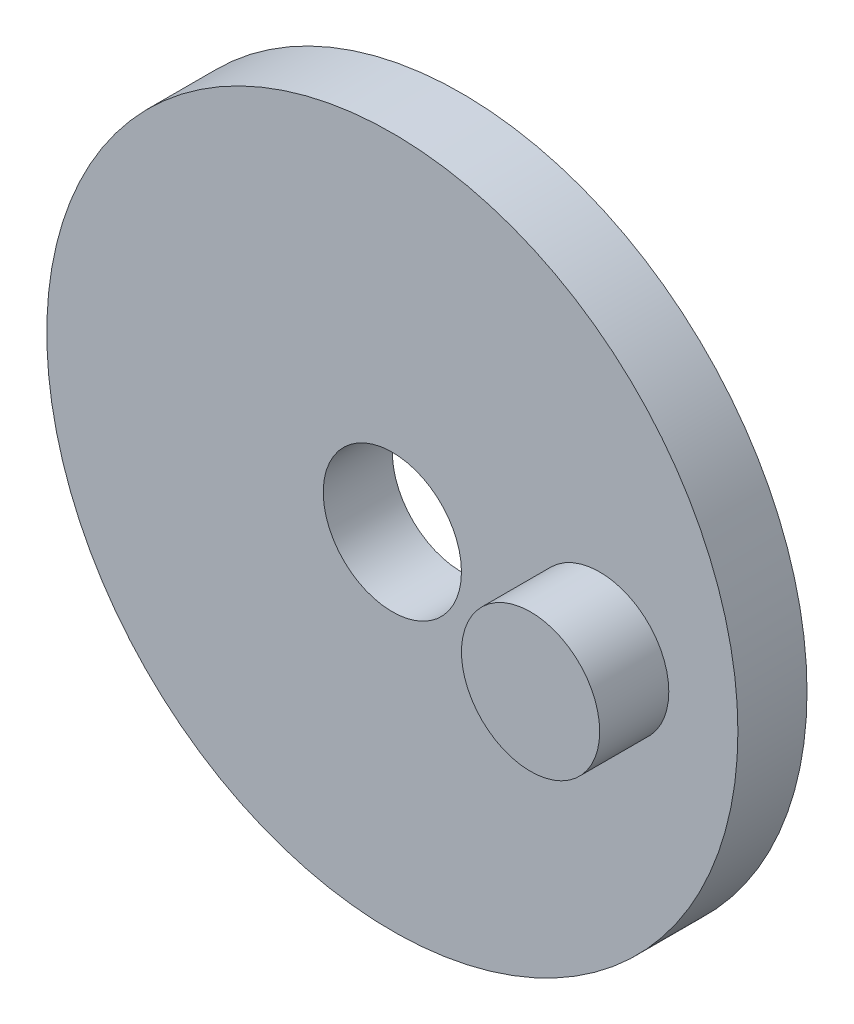
ISO-10303-21;
HEADER;
FILE_DESCRIPTION(('STEP AP214'),'2;1');
FILE_NAME('part.step','',(''),(''),'','','');
FILE_SCHEMA(('AUTOMOTIVE_DESIGN { 1 0 10303 214 1 1 1 1 }'));
ENDSEC;
DATA;
#1=APPLICATION_CONTEXT('core data for automotive mechanical design processes');
#2=APPLICATION_PROTOCOL_DEFINITION('international standard','automotive_design',2000,#1);
#3=PRODUCT_CONTEXT('',#1,'mechanical');
#4=PRODUCT('Part','Part','',(#3));
#5=PRODUCT_RELATED_PRODUCT_CATEGORY('part','',(#4));
#6=PRODUCT_DEFINITION_FORMATION('','',#4);
#7=PRODUCT_DEFINITION_CONTEXT('part definition',#1,'design');
#8=PRODUCT_DEFINITION('design','',#6,#7);
#9=PRODUCT_DEFINITION_SHAPE('','',#8);
#10=(LENGTH_UNIT() NAMED_UNIT(*) SI_UNIT(.MILLI.,.METRE.));
#11=(NAMED_UNIT(*) PLANE_ANGLE_UNIT() SI_UNIT($,.RADIAN.));
#12=(NAMED_UNIT(*) SI_UNIT($,.STERADIAN.) SOLID_ANGLE_UNIT());
#13=UNCERTAINTY_MEASURE_WITH_UNIT(LENGTH_MEASURE(1.E-05),#10,'distance_accuracy_value','');
#14=(GEOMETRIC_REPRESENTATION_CONTEXT(3) GLOBAL_UNCERTAINTY_ASSIGNED_CONTEXT((#13)) GLOBAL_UNIT_ASSIGNED_CONTEXT((#10,
#11,#12)) REPRESENTATION_CONTEXT('',''));
#15=CARTESIAN_POINT('',(0.,0.,0.));
#16=DIRECTION('',(0.,0.,1.));
#17=DIRECTION('',(1.,0.,0.));
#18=AXIS2_PLACEMENT_3D('',#15,#16,#17);
#19=CARTESIAN_POINT('',(0.,0.,10.));
#20=DIRECTION('',(0.,0.,1.));
#21=DIRECTION('',(1.,0.,0.));
#22=AXIS2_PLACEMENT_3D('',#19,#20,#21);
#23=PLANE('',#22);
#24=CARTESIAN_POINT('',(0.,0.,10.));
#25=DIRECTION('',(0.,0.,1.));
#26=DIRECTION('',(1.,0.,0.));
#27=AXIS2_PLACEMENT_3D('',#24,#25,#26);
#28=CIRCLE('',#27,10.);
#29=CARTESIAN_POINT('',(10.,0.,10.));
#30=VERTEX_POINT('',#29);
#31=EDGE_CURVE('E43',#30,#30,#28,.T.);
#32=ORIENTED_EDGE('',*,*,#31,.F.);
#33=EDGE_LOOP('',(#32));
#34=FACE_BOUND('',#33,.T.);
#35=CARTESIAN_POINT('',(0.,0.,10.));
#36=DIRECTION('',(0.,0.,1.));
#37=DIRECTION('',(1.,0.,0.));
#38=AXIS2_PLACEMENT_3D('',#35,#36,#37);
#39=CIRCLE('',#38,50.);
#40=CARTESIAN_POINT('',(50.,0.,10.));
#41=VERTEX_POINT('',#40);
#42=EDGE_CURVE('E10',#41,#41,#39,.T.);
#43=ORIENTED_EDGE('',*,*,#42,.T.);
#44=EDGE_LOOP('',(#43));
#45=FACE_BOUND('',#44,.T.);
#46=CARTESIAN_POINT('',(30.,0.,10.));
#47=DIRECTION('',(0.,0.,1.));
#48=DIRECTION('',(1.,0.,0.));
#49=AXIS2_PLACEMENT_3D('',#46,#47,#48);
#50=CIRCLE('',#49,10.);
#51=CARTESIAN_POINT('',(40.,0.,10.));
#52=VERTEX_POINT('',#51);
#53=EDGE_CURVE('E48',#52,#52,#50,.T.);
#54=ORIENTED_EDGE('',*,*,#53,.F.);
#55=EDGE_LOOP('',(#54));
#56=FACE_BOUND('',#55,.T.);
#57=ADVANCED_FACE('F32',(#34,#45,#56),#23,.T.);
#58=CARTESIAN_POINT('',(0.,0.,0.));
#59=DIRECTION('',(0.,0.,1.));
#60=DIRECTION('',(1.,0.,0.));
#61=AXIS2_PLACEMENT_3D('',#58,#59,#60);
#62=PLANE('',#61);
#63=CARTESIAN_POINT('',(0.,0.,0.));
#64=DIRECTION('',(0.,0.,1.));
#65=DIRECTION('',(1.,0.,0.));
#66=AXIS2_PLACEMENT_3D('',#63,#64,#65);
#67=CIRCLE('',#66,10.);
#68=CARTESIAN_POINT('',(10.,0.,0.));
#69=VERTEX_POINT('',#68);
#70=EDGE_CURVE('E45',#69,#69,#67,.T.);
#71=ORIENTED_EDGE('',*,*,#70,.T.);
#72=EDGE_LOOP('',(#71));
#73=FACE_BOUND('',#72,.T.);
#74=CARTESIAN_POINT('',(0.,0.,0.));
#75=DIRECTION('',(0.,0.,1.));
#76=DIRECTION('',(1.,0.,0.));
#77=AXIS2_PLACEMENT_3D('',#74,#75,#76);
#78=CIRCLE('',#77,50.);
#79=CARTESIAN_POINT('',(50.,0.,0.));
#80=VERTEX_POINT('',#79);
#81=EDGE_CURVE('E36',#80,#80,#78,.T.);
#82=ORIENTED_EDGE('',*,*,#81,.F.);
#83=EDGE_LOOP('',(#82));
#84=FACE_BOUND('',#83,.T.);
#85=ADVANCED_FACE('F72',(#73,#84),#62,.F.);
#86=CARTESIAN_POINT('',(0.,0.,10.));
#87=DIRECTION('',(0.,0.,-1.));
#88=DIRECTION('',(-1.,0.,0.));
#89=AXIS2_PLACEMENT_3D('',#86,#87,#88);
#90=CYLINDRICAL_SURFACE('',#89,50.);
#91=ORIENTED_EDGE('',*,*,#42,.F.);
#92=EDGE_LOOP('',(#91));
#93=FACE_BOUND('',#92,.T.);
#94=ORIENTED_EDGE('',*,*,#81,.T.);
#95=EDGE_LOOP('',(#94));
#96=FACE_BOUND('',#95,.T.);
#97=ADVANCED_FACE('F34',(#93,#96),#90,.T.);
#98=CARTESIAN_POINT('',(0.,0.,10.));
#99=DIRECTION('',(0.,0.,-1.));
#100=DIRECTION('',(-1.,0.,0.));
#101=AXIS2_PLACEMENT_3D('',#98,#99,#100);
#102=CYLINDRICAL_SURFACE('',#101,10.);
#103=ORIENTED_EDGE('',*,*,#31,.T.);
#104=EDGE_LOOP('',(#103));
#105=FACE_BOUND('',#104,.T.);
#106=ORIENTED_EDGE('',*,*,#70,.F.);
#107=EDGE_LOOP('',(#106));
#108=FACE_BOUND('',#107,.T.);
#109=ADVANCED_FACE('F61',(#105,#108),#102,.F.);
#110=CARTESIAN_POINT('',(30.,0.,20.));
#111=DIRECTION('',(0.,0.,-1.));
#112=DIRECTION('',(-1.,0.,0.));
#113=AXIS2_PLACEMENT_3D('',#110,#111,#112);
#114=CYLINDRICAL_SURFACE('',#113,10.);
#115=ORIENTED_EDGE('',*,*,#53,.T.);
#116=EDGE_LOOP('',(#115));
#117=FACE_BOUND('',#116,.T.);
#118=CARTESIAN_POINT('',(30.,0.,20.));
#119=DIRECTION('',(0.,0.,1.));
#120=DIRECTION('',(1.,0.,0.));
#121=AXIS2_PLACEMENT_3D('',#118,#119,#120);
#122=CIRCLE('',#121,10.);
#123=CARTESIAN_POINT('',(40.,0.,20.));
#124=VERTEX_POINT('',#123);
#125=EDGE_CURVE('E53',#124,#124,#122,.T.);
#126=ORIENTED_EDGE('',*,*,#125,.F.);
#127=EDGE_LOOP('',(#126));
#128=FACE_BOUND('',#127,.T.);
#129=ADVANCED_FACE('F59',(#117,#128),#114,.T.);
#130=CARTESIAN_POINT('',(0.,0.,20.));
#131=DIRECTION('',(0.,0.,1.));
#132=DIRECTION('',(1.,0.,0.));
#133=AXIS2_PLACEMENT_3D('',#130,#131,#132);
#134=PLANE('',#133);
#135=ORIENTED_EDGE('',*,*,#125,.T.);
#136=EDGE_LOOP('',(#135));
#137=FACE_BOUND('',#136,.T.);
#138=ADVANCED_FACE('F57',(#137),#134,.T.);
#139=CLOSED_SHELL('',(#57,#85,#97,#109,#129,#138));
#140=MANIFOLD_SOLID_BREP('B2',#139);
#141=ADVANCED_BREP_SHAPE_REPRESENTATION('',(#18,#140),#14);
#142=SHAPE_DEFINITION_REPRESENTATION(#9,#141);
ENDSEC;
END-ISO-10303-21;
